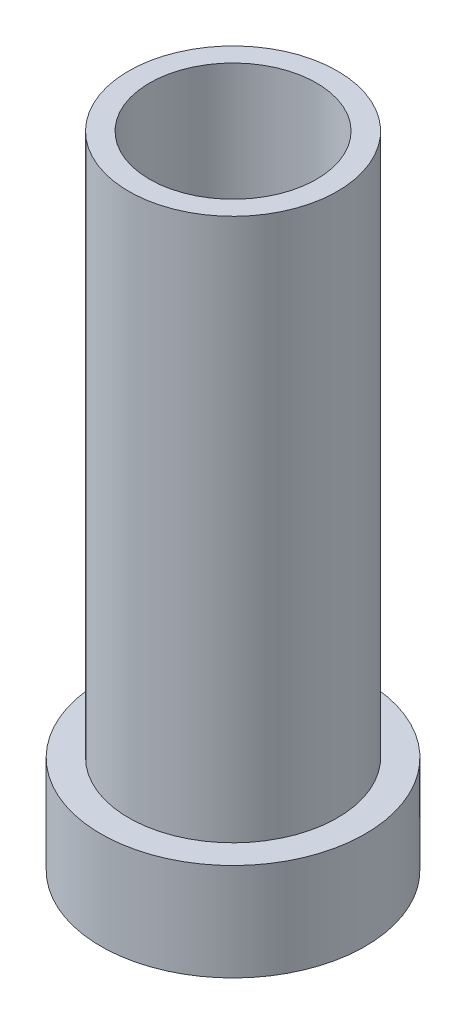
ISO-10303-21;
HEADER;
FILE_DESCRIPTION(('STEP AP214'),'2;1');
FILE_NAME('part.step','',(''),(''),'','','');
FILE_SCHEMA(('AUTOMOTIVE_DESIGN { 1 0 10303 214 1 1 1 1 }'));
ENDSEC;
DATA;
#1=APPLICATION_CONTEXT('core data for automotive mechanical design processes');
#2=APPLICATION_PROTOCOL_DEFINITION('international standard','automotive_design',2000,#1);
#3=PRODUCT_CONTEXT('',#1,'mechanical');
#4=PRODUCT('Part','Part','',(#3));
#5=PRODUCT_RELATED_PRODUCT_CATEGORY('part','',(#4));
#6=PRODUCT_DEFINITION_FORMATION('','',#4);
#7=PRODUCT_DEFINITION_CONTEXT('part definition',#1,'design');
#8=PRODUCT_DEFINITION('design','',#6,#7);
#9=PRODUCT_DEFINITION_SHAPE('','',#8);
#10=(LENGTH_UNIT() NAMED_UNIT(*) SI_UNIT(.MILLI.,.METRE.));
#11=(NAMED_UNIT(*) PLANE_ANGLE_UNIT() SI_UNIT($,.RADIAN.));
#12=(NAMED_UNIT(*) SI_UNIT($,.STERADIAN.) SOLID_ANGLE_UNIT());
#13=UNCERTAINTY_MEASURE_WITH_UNIT(LENGTH_MEASURE(1.E-05),#10,'distance_accuracy_value','');
#14=(GEOMETRIC_REPRESENTATION_CONTEXT(3) GLOBAL_UNCERTAINTY_ASSIGNED_CONTEXT((#13)) GLOBAL_UNIT_ASSIGNED_CONTEXT((#10,
#11,#12)) REPRESENTATION_CONTEXT('',''));
#15=CARTESIAN_POINT('',(0.,0.,0.));
#16=DIRECTION('',(0.,0.,1.));
#17=DIRECTION('',(1.,0.,0.));
#18=AXIS2_PLACEMENT_3D('',#15,#16,#17);
#19=CARTESIAN_POINT('',(4.75,0.,0.));
#20=DIRECTION('',(0.,-1.,0.));
#21=DIRECTION('',(0.,0.,-1.));
#22=AXIS2_PLACEMENT_3D('',#19,#20,#21);
#23=PLANE('',#22);
#24=CARTESIAN_POINT('',(0.,0.,0.));
#25=DIRECTION('',(0.,-1.,0.));
#26=DIRECTION('',(0.,0.,-1.));
#27=AXIS2_PLACEMENT_3D('',#24,#25,#26);
#28=CIRCLE('',#27,2.);
#29=CARTESIAN_POINT('',(0.,0.,-2.));
#30=VERTEX_POINT('',#29);
#31=EDGE_CURVE('E60',#30,#30,#28,.T.);
#32=ORIENTED_EDGE('',*,*,#31,.F.);
#33=EDGE_LOOP('',(#32));
#34=FACE_BOUND('',#33,.T.);
#35=CARTESIAN_POINT('',(0.,0.,0.));
#36=DIRECTION('',(0.,-1.,0.));
#37=DIRECTION('',(0.,0.,-1.));
#38=AXIS2_PLACEMENT_3D('',#35,#36,#37);
#39=CIRCLE('',#38,4.75);
#40=CARTESIAN_POINT('',(0.,0.,-4.75));
#41=VERTEX_POINT('',#40);
#42=EDGE_CURVE('E10',#41,#41,#39,.T.);
#43=ORIENTED_EDGE('',*,*,#42,.T.);
#44=EDGE_LOOP('',(#43));
#45=FACE_BOUND('',#44,.T.);
#46=ADVANCED_FACE('F35',(#34,#45),#23,.T.);
#47=CARTESIAN_POINT('',(0.,0.,0.));
#48=DIRECTION('',(0.,-1.,0.));
#49=DIRECTION('',(0.,0.,-1.));
#50=AXIS2_PLACEMENT_3D('',#47,#48,#49);
#51=CYLINDRICAL_SURFACE('',#50,4.75);
#52=CARTESIAN_POINT('',(0.,3.5,0.));
#53=DIRECTION('',(0.,-1.,0.));
#54=DIRECTION('',(0.,0.,-1.));
#55=AXIS2_PLACEMENT_3D('',#52,#53,#54);
#56=CIRCLE('',#55,4.75);
#57=CARTESIAN_POINT('',(0.,3.5,-4.75));
#58=VERTEX_POINT('',#57);
#59=EDGE_CURVE('E42',#58,#58,#56,.T.);
#60=ORIENTED_EDGE('',*,*,#59,.T.);
#61=EDGE_LOOP('',(#60));
#62=FACE_BOUND('',#61,.T.);
#63=ORIENTED_EDGE('',*,*,#42,.F.);
#64=EDGE_LOOP('',(#63));
#65=FACE_BOUND('',#64,.T.);
#66=ADVANCED_FACE('F96',(#62,#65),#51,.T.);
#67=CARTESIAN_POINT('',(3.75,3.5,0.));
#68=DIRECTION('',(0.,1.,0.));
#69=DIRECTION('',(0.,0.,1.));
#70=AXIS2_PLACEMENT_3D('',#67,#68,#69);
#71=PLANE('',#70);
#72=CARTESIAN_POINT('',(0.,3.5,0.));
#73=DIRECTION('',(0.,-1.,0.));
#74=DIRECTION('',(0.,0.,-1.));
#75=AXIS2_PLACEMENT_3D('',#72,#73,#74);
#76=CIRCLE('',#75,3.75);
#77=CARTESIAN_POINT('',(0.,3.5,-3.75));
#78=VERTEX_POINT('',#77);
#79=EDGE_CURVE('E46',#78,#78,#76,.T.);
#80=ORIENTED_EDGE('',*,*,#79,.T.);
#81=EDGE_LOOP('',(#80));
#82=FACE_BOUND('',#81,.T.);
#83=ORIENTED_EDGE('',*,*,#59,.F.);
#84=EDGE_LOOP('',(#83));
#85=FACE_BOUND('',#84,.T.);
#86=ADVANCED_FACE('F90',(#82,#85),#71,.T.);
#87=CARTESIAN_POINT('',(0.,0.,0.));
#88=DIRECTION('',(0.,-1.,0.));
#89=DIRECTION('',(0.,0.,-1.));
#90=AXIS2_PLACEMENT_3D('',#87,#88,#89);
#91=CYLINDRICAL_SURFACE('',#90,3.75);
#92=CARTESIAN_POINT('',(0.,23.,0.));
#93=DIRECTION('',(0.,-1.,0.));
#94=DIRECTION('',(0.,0.,-1.));
#95=AXIS2_PLACEMENT_3D('',#92,#93,#94);
#96=CIRCLE('',#95,3.75);
#97=CARTESIAN_POINT('',(0.,23.,-3.75));
#98=VERTEX_POINT('',#97);
#99=EDGE_CURVE('E51',#98,#98,#96,.T.);
#100=ORIENTED_EDGE('',*,*,#99,.T.);
#101=EDGE_LOOP('',(#100));
#102=FACE_BOUND('',#101,.T.);
#103=ORIENTED_EDGE('',*,*,#79,.F.);
#104=EDGE_LOOP('',(#103));
#105=FACE_BOUND('',#104,.T.);
#106=ADVANCED_FACE('F84',(#102,#105),#91,.T.);
#107=CARTESIAN_POINT('',(3.75,23.,0.));
#108=DIRECTION('',(0.,1.,0.));
#109=DIRECTION('',(0.,0.,1.));
#110=AXIS2_PLACEMENT_3D('',#107,#108,#109);
#111=PLANE('',#110);
#112=CARTESIAN_POINT('',(0.,23.,0.));
#113=DIRECTION('',(0.,1.,0.));
#114=DIRECTION('',(0.,0.,1.));
#115=AXIS2_PLACEMENT_3D('',#112,#113,#114);
#116=CIRCLE('',#115,3.);
#117=CARTESIAN_POINT('',(0.,23.,3.));
#118=VERTEX_POINT('',#117);
#119=EDGE_CURVE('E55',#118,#118,#116,.T.);
#120=ORIENTED_EDGE('',*,*,#119,.F.);
#121=EDGE_LOOP('',(#120));
#122=FACE_BOUND('',#121,.T.);
#123=ORIENTED_EDGE('',*,*,#99,.F.);
#124=EDGE_LOOP('',(#123));
#125=FACE_BOUND('',#124,.T.);
#126=ADVANCED_FACE('F78',(#122,#125),#111,.T.);
#127=CARTESIAN_POINT('',(0.,13.,0.));
#128=DIRECTION('',(0.,1.,0.));
#129=DIRECTION('',(0.,0.,1.));
#130=AXIS2_PLACEMENT_3D('',#127,#128,#129);
#131=CYLINDRICAL_SURFACE('',#130,3.);
#132=CARTESIAN_POINT('',(0.,13.,0.));
#133=DIRECTION('',(0.,1.,0.));
#134=DIRECTION('',(0.,0.,1.));
#135=AXIS2_PLACEMENT_3D('',#132,#133,#134);
#136=CIRCLE('',#135,3.);
#137=CARTESIAN_POINT('',(0.,13.,3.));
#138=VERTEX_POINT('',#137);
#139=EDGE_CURVE('E54',#138,#138,#136,.T.);
#140=ORIENTED_EDGE('',*,*,#139,.F.);
#141=EDGE_LOOP('',(#140));
#142=FACE_BOUND('',#141,.T.);
#143=ORIENTED_EDGE('',*,*,#119,.T.);
#144=EDGE_LOOP('',(#143));
#145=FACE_BOUND('',#144,.T.);
#146=ADVANCED_FACE('F72',(#142,#145),#131,.F.);
#147=CARTESIAN_POINT('',(0.,13.,0.));
#148=DIRECTION('',(0.,1.,0.));
#149=DIRECTION('',(0.,0.,1.));
#150=AXIS2_PLACEMENT_3D('',#147,#148,#149);
#151=PLANE('',#150);
#152=CARTESIAN_POINT('',(0.,13.,0.));
#153=DIRECTION('',(0.,1.,0.));
#154=DIRECTION('',(0.,0.,1.));
#155=AXIS2_PLACEMENT_3D('',#152,#153,#154);
#156=CIRCLE('',#155,2.);
#157=CARTESIAN_POINT('',(0.,13.,2.));
#158=VERTEX_POINT('',#157);
#159=EDGE_CURVE('E38',#158,#158,#156,.T.);
#160=ORIENTED_EDGE('',*,*,#159,.F.);
#161=EDGE_LOOP('',(#160));
#162=FACE_BOUND('',#161,.T.);
#163=ORIENTED_EDGE('',*,*,#139,.T.);
#164=EDGE_LOOP('',(#163));
#165=FACE_BOUND('',#164,.T.);
#166=ADVANCED_FACE('F69',(#162,#165),#151,.T.);
#167=CARTESIAN_POINT('',(0.,23.,0.));
#168=DIRECTION('',(0.,-1.,0.));
#169=DIRECTION('',(0.,0.,-1.));
#170=AXIS2_PLACEMENT_3D('',#167,#168,#169);
#171=CYLINDRICAL_SURFACE('',#170,2.);
#172=ORIENTED_EDGE('',*,*,#159,.T.);
#173=EDGE_LOOP('',(#172));
#174=FACE_BOUND('',#173,.T.);
#175=ORIENTED_EDGE('',*,*,#31,.T.);
#176=EDGE_LOOP('',(#175));
#177=FACE_BOUND('',#176,.T.);
#178=ADVANCED_FACE('F67',(#174,#177),#171,.F.);
#179=CLOSED_SHELL('',(#46,#66,#86,#106,#126,#146,#166,#178));
#180=MANIFOLD_SOLID_BREP('B2',#179);
#181=ADVANCED_BREP_SHAPE_REPRESENTATION('',(#18,#180),#14);
#182=SHAPE_DEFINITION_REPRESENTATION(#9,#181);
ENDSEC;
END-ISO-10303-21;
